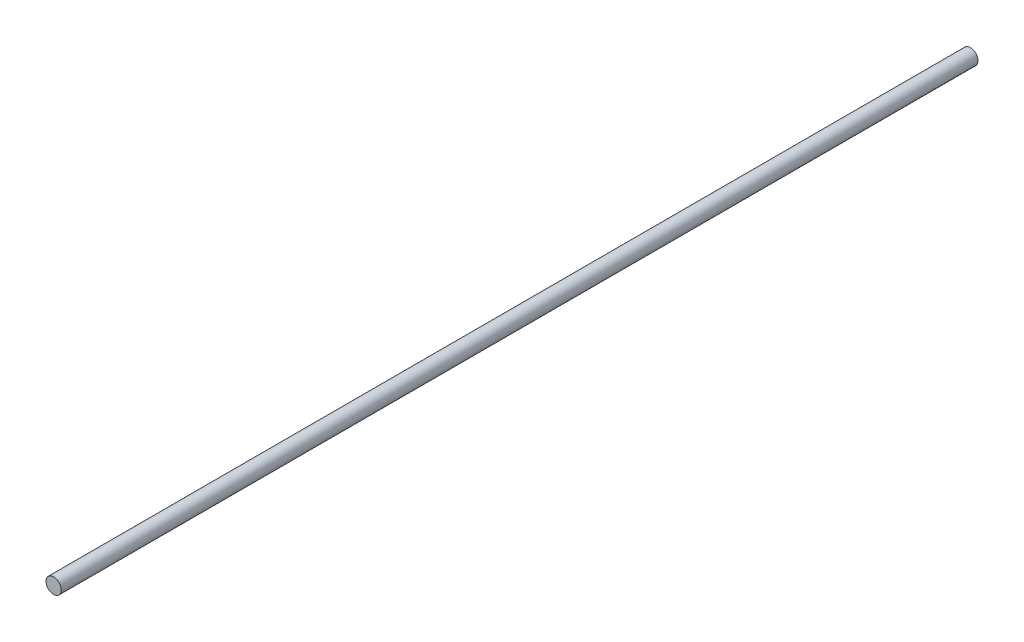
ISO-10303-21;
HEADER;
FILE_DESCRIPTION(('STEP AP214'),'2;1');
FILE_NAME('part.step','',(''),(''),'','','');
FILE_SCHEMA(('AUTOMOTIVE_DESIGN { 1 0 10303 214 1 1 1 1 }'));
ENDSEC;
DATA;
#1=APPLICATION_CONTEXT('core data for automotive mechanical design processes');
#2=APPLICATION_PROTOCOL_DEFINITION('international standard','automotive_design',2000,#1);
#3=PRODUCT_CONTEXT('',#1,'mechanical');
#4=PRODUCT('Part','Part','',(#3));
#5=PRODUCT_RELATED_PRODUCT_CATEGORY('part','',(#4));
#6=PRODUCT_DEFINITION_FORMATION('','',#4);
#7=PRODUCT_DEFINITION_CONTEXT('part definition',#1,'design');
#8=PRODUCT_DEFINITION('design','',#6,#7);
#9=PRODUCT_DEFINITION_SHAPE('','',#8);
#10=(LENGTH_UNIT() NAMED_UNIT(*) SI_UNIT(.MILLI.,.METRE.));
#11=(NAMED_UNIT(*) PLANE_ANGLE_UNIT() SI_UNIT($,.RADIAN.));
#12=(NAMED_UNIT(*) SI_UNIT($,.STERADIAN.) SOLID_ANGLE_UNIT());
#13=UNCERTAINTY_MEASURE_WITH_UNIT(LENGTH_MEASURE(1.E-05),#10,'distance_accuracy_value','');
#14=(GEOMETRIC_REPRESENTATION_CONTEXT(3) GLOBAL_UNCERTAINTY_ASSIGNED_CONTEXT((#13)) GLOBAL_UNIT_ASSIGNED_CONTEXT((#10,
#11,#12)) REPRESENTATION_CONTEXT('',''));
#15=CARTESIAN_POINT('',(0.,0.,0.));
#16=DIRECTION('',(0.,0.,1.));
#17=DIRECTION('',(1.,0.,0.));
#18=AXIS2_PLACEMENT_3D('',#15,#16,#17);
#19=CARTESIAN_POINT('',(0.,0.,480.));
#20=DIRECTION('',(0.,0.,-1.));
#21=DIRECTION('',(-1.,0.,0.));
#22=AXIS2_PLACEMENT_3D('',#19,#20,#21);
#23=CYLINDRICAL_SURFACE('',#22,4.);
#24=CARTESIAN_POINT('',(0.,0.,480.));
#25=DIRECTION('',(0.,0.,1.));
#26=DIRECTION('',(1.,0.,0.));
#27=AXIS2_PLACEMENT_3D('',#24,#25,#26);
#28=CIRCLE('',#27,4.);
#29=CARTESIAN_POINT('',(4.,0.,480.));
#30=VERTEX_POINT('',#29);
#31=EDGE_CURVE('E10',#30,#30,#28,.T.);
#32=ORIENTED_EDGE('',*,*,#31,.F.);
#33=EDGE_LOOP('',(#32));
#34=FACE_BOUND('',#33,.T.);
#35=CARTESIAN_POINT('',(0.,0.,0.));
#36=DIRECTION('',(0.,0.,1.));
#37=DIRECTION('',(1.,0.,0.));
#38=AXIS2_PLACEMENT_3D('',#35,#36,#37);
#39=CIRCLE('',#38,4.);
#40=CARTESIAN_POINT('',(4.,0.,0.));
#41=VERTEX_POINT('',#40);
#42=EDGE_CURVE('E33',#41,#41,#39,.T.);
#43=ORIENTED_EDGE('',*,*,#42,.T.);
#44=EDGE_LOOP('',(#43));
#45=FACE_BOUND('',#44,.T.);
#46=ADVANCED_FACE('F30',(#34,#45),#23,.T.);
#47=CARTESIAN_POINT('',(0.,0.,480.));
#48=DIRECTION('',(0.,0.,1.));
#49=DIRECTION('',(1.,0.,0.));
#50=AXIS2_PLACEMENT_3D('',#47,#48,#49);
#51=PLANE('',#50);
#52=ORIENTED_EDGE('',*,*,#31,.T.);
#53=EDGE_LOOP('',(#52));
#54=FACE_BOUND('',#53,.T.);
#55=ADVANCED_FACE('F45',(#54),#51,.T.);
#56=CARTESIAN_POINT('',(0.,0.,0.));
#57=DIRECTION('',(0.,0.,1.));
#58=DIRECTION('',(1.,0.,0.));
#59=AXIS2_PLACEMENT_3D('',#56,#57,#58);
#60=PLANE('',#59);
#61=ORIENTED_EDGE('',*,*,#42,.F.);
#62=EDGE_LOOP('',(#61));
#63=FACE_BOUND('',#62,.T.);
#64=ADVANCED_FACE('F43',(#63),#60,.F.);
#65=CLOSED_SHELL('',(#46,#55,#64));
#66=MANIFOLD_SOLID_BREP('B2',#65);
#67=ADVANCED_BREP_SHAPE_REPRESENTATION('',(#18,#66),#14);
#68=SHAPE_DEFINITION_REPRESENTATION(#9,#67);
ENDSEC;
END-ISO-10303-21;
